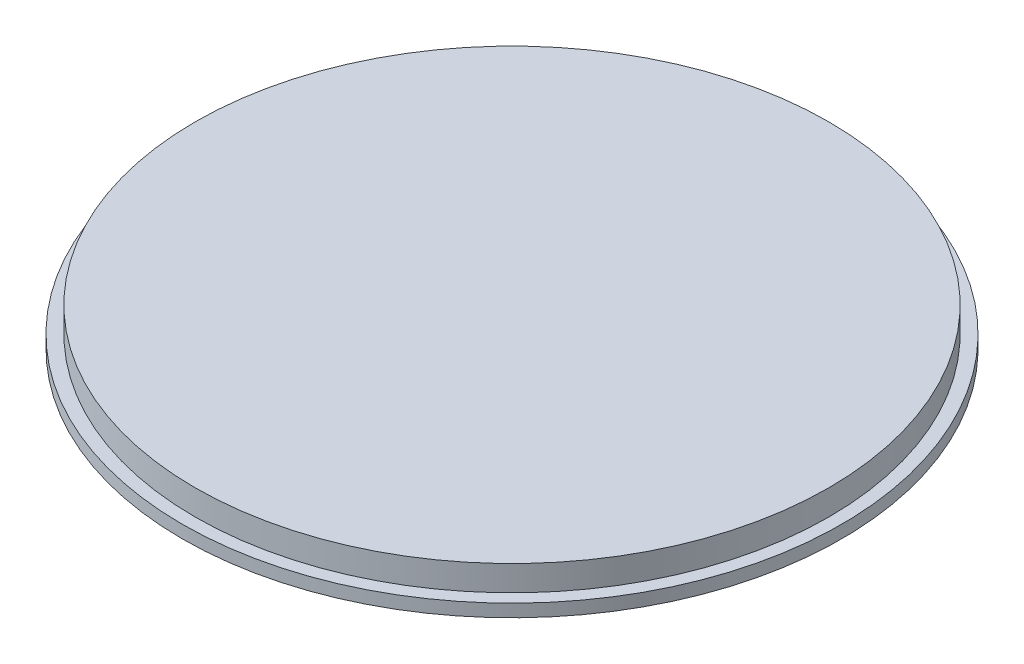
ISO-10303-21;
HEADER;
FILE_DESCRIPTION(('STEP AP214'),'2;1');
FILE_NAME('part.step','',(''),(''),'','','');
FILE_SCHEMA(('AUTOMOTIVE_DESIGN { 1 0 10303 214 1 1 1 1 }'));
ENDSEC;
DATA;
#1=APPLICATION_CONTEXT('core data for automotive mechanical design processes');
#2=APPLICATION_PROTOCOL_DEFINITION('international standard','automotive_design',2000,#1);
#3=PRODUCT_CONTEXT('',#1,'mechanical');
#4=PRODUCT('Part','Part','',(#3));
#5=PRODUCT_RELATED_PRODUCT_CATEGORY('part','',(#4));
#6=PRODUCT_DEFINITION_FORMATION('','',#4);
#7=PRODUCT_DEFINITION_CONTEXT('part definition',#1,'design');
#8=PRODUCT_DEFINITION('design','',#6,#7);
#9=PRODUCT_DEFINITION_SHAPE('','',#8);
#10=(LENGTH_UNIT() NAMED_UNIT(*) SI_UNIT(.MILLI.,.METRE.));
#11=(NAMED_UNIT(*) PLANE_ANGLE_UNIT() SI_UNIT($,.RADIAN.));
#12=(NAMED_UNIT(*) SI_UNIT($,.STERADIAN.) SOLID_ANGLE_UNIT());
#13=UNCERTAINTY_MEASURE_WITH_UNIT(LENGTH_MEASURE(1.E-05),#10,'distance_accuracy_value','');
#14=(GEOMETRIC_REPRESENTATION_CONTEXT(3) GLOBAL_UNCERTAINTY_ASSIGNED_CONTEXT((#13)) GLOBAL_UNIT_ASSIGNED_CONTEXT((#10,
#11,#12)) REPRESENTATION_CONTEXT('',''));
#15=CARTESIAN_POINT('',(0.,0.,0.));
#16=DIRECTION('',(0.,0.,1.));
#17=DIRECTION('',(1.,0.,0.));
#18=AXIS2_PLACEMENT_3D('',#15,#16,#17);
#19=CARTESIAN_POINT('',(0.,1.,0.));
#20=DIRECTION('',(0.,-1.,0.));
#21=DIRECTION('',(0.,0.,-1.));
#22=AXIS2_PLACEMENT_3D('',#19,#20,#21);
#23=CYLINDRICAL_SURFACE('',#22,26.);
#24=CARTESIAN_POINT('',(0.,1.,0.));
#25=DIRECTION('',(0.,1.,0.));
#26=DIRECTION('',(0.,0.,1.));
#27=AXIS2_PLACEMENT_3D('',#24,#25,#26);
#28=CIRCLE('',#27,26.);
#29=CARTESIAN_POINT('',(0.,1.,26.));
#30=VERTEX_POINT('',#29);
#31=EDGE_CURVE('E47',#30,#30,#28,.T.);
#32=ORIENTED_EDGE('',*,*,#31,.F.);
#33=EDGE_LOOP('',(#32));
#34=FACE_BOUND('',#33,.T.);
#35=CARTESIAN_POINT('',(0.,0.,0.));
#36=DIRECTION('',(0.,1.,0.));
#37=DIRECTION('',(0.,0.,1.));
#38=AXIS2_PLACEMENT_3D('',#35,#36,#37);
#39=CIRCLE('',#38,26.);
#40=CARTESIAN_POINT('',(0.,0.,26.));
#41=VERTEX_POINT('',#40);
#42=EDGE_CURVE('E42',#41,#41,#39,.T.);
#43=ORIENTED_EDGE('',*,*,#42,.T.);
#44=EDGE_LOOP('',(#43));
#45=FACE_BOUND('',#44,.T.);
#46=ADVANCED_FACE('F39',(#34,#45),#23,.T.);
#47=CARTESIAN_POINT('',(0.,1.,0.));
#48=DIRECTION('',(0.,1.,0.));
#49=DIRECTION('',(0.,0.,1.));
#50=AXIS2_PLACEMENT_3D('',#47,#48,#49);
#51=PLANE('',#50);
#52=CARTESIAN_POINT('',(0.,1.,0.));
#53=DIRECTION('',(0.,1.,0.));
#54=DIRECTION('',(0.,0.,1.));
#55=AXIS2_PLACEMENT_3D('',#52,#53,#54);
#56=CIRCLE('',#55,25.);
#57=CARTESIAN_POINT('',(0.,1.,25.));
#58=VERTEX_POINT('',#57);
#59=EDGE_CURVE('E10',#58,#58,#56,.T.);
#60=ORIENTED_EDGE('',*,*,#59,.F.);
#61=EDGE_LOOP('',(#60));
#62=FACE_BOUND('',#61,.T.);
#63=ORIENTED_EDGE('',*,*,#31,.T.);
#64=EDGE_LOOP('',(#63));
#65=FACE_BOUND('',#64,.T.);
#66=ADVANCED_FACE('F67',(#62,#65),#51,.T.);
#67=CARTESIAN_POINT('',(0.,0.,0.));
#68=DIRECTION('',(0.,1.,0.));
#69=DIRECTION('',(0.,0.,1.));
#70=AXIS2_PLACEMENT_3D('',#67,#68,#69);
#71=PLANE('',#70);
#72=ORIENTED_EDGE('',*,*,#42,.F.);
#73=EDGE_LOOP('',(#72));
#74=FACE_BOUND('',#73,.T.);
#75=ADVANCED_FACE('F64',(#74),#71,.F.);
#76=CARTESIAN_POINT('',(0.,3.,0.));
#77=DIRECTION('',(0.,-1.,0.));
#78=DIRECTION('',(0.,0.,-1.));
#79=AXIS2_PLACEMENT_3D('',#76,#77,#78);
#80=CYLINDRICAL_SURFACE('',#79,25.);
#81=CARTESIAN_POINT('',(0.,3.,0.));
#82=DIRECTION('',(0.,1.,0.));
#83=DIRECTION('',(0.,0.,1.));
#84=AXIS2_PLACEMENT_3D('',#81,#82,#83);
#85=CIRCLE('',#84,25.);
#86=CARTESIAN_POINT('',(0.,3.,25.));
#87=VERTEX_POINT('',#86);
#88=EDGE_CURVE('E54',#87,#87,#85,.T.);
#89=ORIENTED_EDGE('',*,*,#88,.F.);
#90=EDGE_LOOP('',(#89));
#91=FACE_BOUND('',#90,.T.);
#92=ORIENTED_EDGE('',*,*,#59,.T.);
#93=EDGE_LOOP('',(#92));
#94=FACE_BOUND('',#93,.T.);
#95=ADVANCED_FACE('F66',(#91,#94),#80,.T.);
#96=CARTESIAN_POINT('',(0.,3.,0.));
#97=DIRECTION('',(0.,1.,0.));
#98=DIRECTION('',(0.,0.,1.));
#99=AXIS2_PLACEMENT_3D('',#96,#97,#98);
#100=PLANE('',#99);
#101=ORIENTED_EDGE('',*,*,#88,.T.);
#102=EDGE_LOOP('',(#101));
#103=FACE_BOUND('',#102,.T.);
#104=ADVANCED_FACE('F72',(#103),#100,.T.);
#105=CLOSED_SHELL('',(#46,#66,#75,#95,#104));
#106=MANIFOLD_SOLID_BREP('B2',#105);
#107=ADVANCED_BREP_SHAPE_REPRESENTATION('',(#18,#106),#14);
#108=SHAPE_DEFINITION_REPRESENTATION(#9,#107);
ENDSEC;
END-ISO-10303-21;
